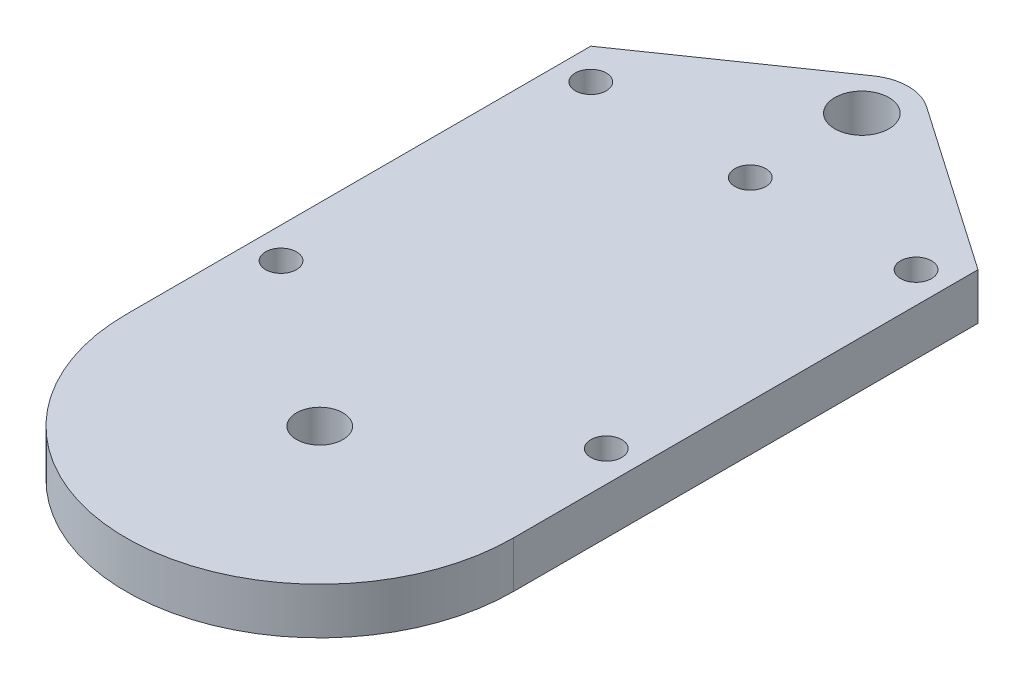
ISO-10303-21;
HEADER;
FILE_DESCRIPTION(('STEP AP214'),'2;1');
FILE_NAME('part.step','',(''),(''),'','','');
FILE_SCHEMA(('AUTOMOTIVE_DESIGN { 1 0 10303 214 1 1 1 1 }'));
ENDSEC;
DATA;
#1=APPLICATION_CONTEXT('core data for automotive mechanical design processes');
#2=APPLICATION_PROTOCOL_DEFINITION('international standard','automotive_design',2000,#1);
#3=PRODUCT_CONTEXT('',#1,'mechanical');
#4=PRODUCT('Part','Part','',(#3));
#5=PRODUCT_RELATED_PRODUCT_CATEGORY('part','',(#4));
#6=PRODUCT_DEFINITION_FORMATION('','',#4);
#7=PRODUCT_DEFINITION_CONTEXT('part definition',#1,'design');
#8=PRODUCT_DEFINITION('design','',#6,#7);
#9=PRODUCT_DEFINITION_SHAPE('','',#8);
#10=(LENGTH_UNIT() NAMED_UNIT(*) SI_UNIT(.MILLI.,.METRE.));
#11=(NAMED_UNIT(*) PLANE_ANGLE_UNIT() SI_UNIT($,.RADIAN.));
#12=(NAMED_UNIT(*) SI_UNIT($,.STERADIAN.) SOLID_ANGLE_UNIT());
#13=UNCERTAINTY_MEASURE_WITH_UNIT(LENGTH_MEASURE(1.E-05),#10,'distance_accuracy_value','');
#14=(GEOMETRIC_REPRESENTATION_CONTEXT(3) GLOBAL_UNCERTAINTY_ASSIGNED_CONTEXT((#13)) GLOBAL_UNIT_ASSIGNED_CONTEXT((#10,
#11,#12)) REPRESENTATION_CONTEXT('',''));
#15=CARTESIAN_POINT('',(0.,0.,0.));
#16=DIRECTION('',(0.,0.,1.));
#17=DIRECTION('',(1.,0.,0.));
#18=AXIS2_PLACEMENT_3D('',#15,#16,#17);
#19=CARTESIAN_POINT('',(0.,3.,15.));
#20=DIRECTION('',(0.,-1.,0.));
#21=DIRECTION('',(0.,0.,-1.));
#22=AXIS2_PLACEMENT_3D('',#19,#20,#21);
#23=CYLINDRICAL_SURFACE('',#22,12.5);
#24=CARTESIAN_POINT('',(0.,0.,15.));
#25=DIRECTION('',(0.,1.,0.));
#26=DIRECTION('',(0.,0.,1.));
#27=AXIS2_PLACEMENT_3D('',#24,#25,#26);
#28=CIRCLE('',#27,12.5);
#29=CARTESIAN_POINT('',(-12.5,0.,15.));
#30=VERTEX_POINT('',#29);
#31=CARTESIAN_POINT('',(12.5,0.,15.));
#32=VERTEX_POINT('',#31);
#33=EDGE_CURVE('E106',#30,#32,#28,.T.);
#34=ORIENTED_EDGE('',*,*,#33,.T.);
#35=DIRECTION('',(0.,-1.,0.));
#36=VECTOR('',#35,1.);
#37=CARTESIAN_POINT('',(12.5,3.,15.));
#38=LINE('',#37,#36);
#39=CARTESIAN_POINT('',(12.5,3.,15.));
#40=VERTEX_POINT('',#39);
#41=EDGE_CURVE('E104',#40,#32,#38,.T.);
#42=ORIENTED_EDGE('',*,*,#41,.F.);
#43=CARTESIAN_POINT('',(0.,3.,15.));
#44=DIRECTION('',(0.,1.,0.));
#45=DIRECTION('',(0.,0.,1.));
#46=AXIS2_PLACEMENT_3D('',#43,#44,#45);
#47=CIRCLE('',#46,12.5);
#48=CARTESIAN_POINT('',(-12.5,3.,15.));
#49=VERTEX_POINT('',#48);
#50=EDGE_CURVE('E90',#49,#40,#47,.T.);
#51=ORIENTED_EDGE('',*,*,#50,.F.);
#52=DIRECTION('',(0.,-1.,0.));
#53=VECTOR('',#52,1.);
#54=CARTESIAN_POINT('',(-12.5,3.,15.));
#55=LINE('',#54,#53);
#56=EDGE_CURVE('E142',#49,#30,#55,.T.);
#57=ORIENTED_EDGE('',*,*,#56,.T.);
#58=EDGE_LOOP('',(#34,#42,#51,#57));
#59=FACE_BOUND('',#58,.T.);
#60=ADVANCED_FACE('F37',(#59),#23,.T.);
#61=CARTESIAN_POINT('',(12.5,3.,0.));
#62=DIRECTION('',(1.,0.,0.));
#63=DIRECTION('',(0.,0.,-1.));
#64=AXIS2_PLACEMENT_3D('',#61,#62,#63);
#65=PLANE('',#64);
#66=DIRECTION('',(0.,0.,1.));
#67=VECTOR('',#66,1.);
#68=CARTESIAN_POINT('',(12.5,0.,0.));
#69=LINE('',#68,#67);
#70=CARTESIAN_POINT('',(12.5,0.,-15.));
#71=VERTEX_POINT('',#70);
#72=EDGE_CURVE('E144',#71,#32,#69,.T.);
#73=ORIENTED_EDGE('',*,*,#72,.F.);
#74=DIRECTION('',(0.,-1.,0.));
#75=VECTOR('',#74,1.);
#76=CARTESIAN_POINT('',(12.5,3.,-15.));
#77=LINE('',#76,#75);
#78=CARTESIAN_POINT('',(12.5,3.,-15.));
#79=VERTEX_POINT('',#78);
#80=EDGE_CURVE('E111',#79,#71,#77,.T.);
#81=ORIENTED_EDGE('',*,*,#80,.F.);
#82=DIRECTION('',(0.,0.,1.));
#83=VECTOR('',#82,1.);
#84=CARTESIAN_POINT('',(12.5,3.,0.));
#85=LINE('',#84,#83);
#86=EDGE_CURVE('E95',#79,#40,#85,.T.);
#87=ORIENTED_EDGE('',*,*,#86,.T.);
#88=ORIENTED_EDGE('',*,*,#41,.T.);
#89=EDGE_LOOP('',(#73,#81,#87,#88));
#90=FACE_BOUND('',#89,.T.);
#91=ADVANCED_FACE('F113',(#90),#65,.T.);
#92=CARTESIAN_POINT('',(11.0646118522805,3.,-15.9930567354681));
#93=DIRECTION('',(-0.568949096507771,0.,0.822372741269427));
#94=DIRECTION('',(0.822372741269427,0.,0.568949096507771));
#95=AXIS2_PLACEMENT_3D('',#92,#93,#94);
#96=PLANE('',#95);
#97=DIRECTION('',(-0.822372741269427,0.,-0.568949096507771));
#98=VECTOR('',#97,1.);
#99=CARTESIAN_POINT('',(11.0646118522805,0.,-15.9930567354681));
#100=LINE('',#99,#98);
#101=CARTESIAN_POINT('',(1.70684728952331,0.,-22.4671182238083));
#102=VERTEX_POINT('',#101);
#103=EDGE_CURVE('E146',#71,#102,#100,.T.);
#104=ORIENTED_EDGE('',*,*,#103,.T.);
#105=DIRECTION('',(0.,-1.,0.));
#106=VECTOR('',#105,1.);
#107=CARTESIAN_POINT('',(1.70684728952331,3.,-22.4671182238083));
#108=LINE('',#107,#106);
#109=CARTESIAN_POINT('',(1.70684728952331,3.,-22.4671182238083));
#110=VERTEX_POINT('',#109);
#111=EDGE_CURVE('E45',#102,#110,#108,.F.);
#112=ORIENTED_EDGE('',*,*,#111,.T.);
#113=DIRECTION('',(-0.822372741269427,0.,-0.568949096507771));
#114=VECTOR('',#113,1.);
#115=CARTESIAN_POINT('',(11.0646118522805,3.,-15.9930567354681));
#116=LINE('',#115,#114);
#117=EDGE_CURVE('E114',#79,#110,#116,.T.);
#118=ORIENTED_EDGE('',*,*,#117,.F.);
#119=ORIENTED_EDGE('',*,*,#80,.T.);
#120=EDGE_LOOP('',(#104,#112,#118,#119));
#121=FACE_BOUND('',#120,.T.);
#122=ADVANCED_FACE('F209',(#121),#96,.F.);
#123=CARTESIAN_POINT('',(-11.0646118522805,3.,-15.9930567354681));
#124=DIRECTION('',(0.568949096507771,0.,0.822372741269427));
#125=DIRECTION('',(0.822372741269427,0.,-0.568949096507771));
#126=AXIS2_PLACEMENT_3D('',#123,#124,#125);
#127=PLANE('',#126);
#128=DIRECTION('',(-0.822372741269427,0.,0.568949096507771));
#129=VECTOR('',#128,1.);
#130=CARTESIAN_POINT('',(-11.0646118522805,3.,-15.9930567354681));
#131=LINE('',#130,#129);
#132=CARTESIAN_POINT('',(-1.70684728952331,3.,-22.4671182238083));
#133=VERTEX_POINT('',#132);
#134=CARTESIAN_POINT('',(-12.5,3.,-15.));
#135=VERTEX_POINT('',#134);
#136=EDGE_CURVE('E116',#133,#135,#131,.T.);
#137=ORIENTED_EDGE('',*,*,#136,.F.);
#138=DIRECTION('',(0.,-1.,0.));
#139=VECTOR('',#138,1.);
#140=CARTESIAN_POINT('',(-1.70684728952331,3.,-22.4671182238083));
#141=LINE('',#140,#139);
#142=CARTESIAN_POINT('',(-1.70684728952331,0.,-22.4671182238083));
#143=VERTEX_POINT('',#142);
#144=EDGE_CURVE('E110',#133,#143,#141,.T.);
#145=ORIENTED_EDGE('',*,*,#144,.T.);
#146=DIRECTION('',(-0.822372741269427,0.,0.568949096507771));
#147=VECTOR('',#146,1.);
#148=CARTESIAN_POINT('',(-11.0646118522805,0.,-15.9930567354681));
#149=LINE('',#148,#147);
#150=CARTESIAN_POINT('',(-12.5,0.,-15.));
#151=VERTEX_POINT('',#150);
#152=EDGE_CURVE('E148',#143,#151,#149,.T.);
#153=ORIENTED_EDGE('',*,*,#152,.T.);
#154=DIRECTION('',(0.,-1.,0.));
#155=VECTOR('',#154,1.);
#156=CARTESIAN_POINT('',(-12.5,3.,-15.));
#157=LINE('',#156,#155);
#158=EDGE_CURVE('E173',#135,#151,#157,.T.);
#159=ORIENTED_EDGE('',*,*,#158,.F.);
#160=EDGE_LOOP('',(#137,#145,#153,#159));
#161=FACE_BOUND('',#160,.T.);
#162=ADVANCED_FACE('F182',(#161),#127,.F.);
#163=CARTESIAN_POINT('',(10.5000000000002,3.,7.));
#164=DIRECTION('',(0.,-1.,0.));
#165=DIRECTION('',(0.,0.,-1.));
#166=AXIS2_PLACEMENT_3D('',#163,#164,#165);
#167=CYLINDRICAL_SURFACE('',#166,1.);
#168=CARTESIAN_POINT('',(10.5000000000002,3.,7.));
#169=DIRECTION('',(0.,1.,0.));
#170=DIRECTION('',(0.,0.,1.));
#171=AXIS2_PLACEMENT_3D('',#168,#169,#170);
#172=CIRCLE('',#171,1.);
#173=CARTESIAN_POINT('',(10.5000000000002,3.,8.));
#174=VERTEX_POINT('',#173);
#175=EDGE_CURVE('E136',#174,#174,#172,.F.);
#176=ORIENTED_EDGE('',*,*,#175,.F.);
#177=EDGE_LOOP('',(#176));
#178=FACE_BOUND('',#177,.T.);
#179=CARTESIAN_POINT('',(10.5000000000002,0.,7.));
#180=DIRECTION('',(0.,1.,0.));
#181=DIRECTION('',(0.,0.,1.));
#182=AXIS2_PLACEMENT_3D('',#179,#180,#181);
#183=CIRCLE('',#182,1.);
#184=CARTESIAN_POINT('',(10.5000000000002,0.,8.));
#185=VERTEX_POINT('',#184);
#186=EDGE_CURVE('E167',#185,#185,#183,.F.);
#187=ORIENTED_EDGE('',*,*,#186,.T.);
#188=EDGE_LOOP('',(#187));
#189=FACE_BOUND('',#188,.T.);
#190=ADVANCED_FACE('F214',(#178,#189),#167,.F.);
#191=CARTESIAN_POINT('',(-10.4999999999998,3.,7.));
#192=DIRECTION('',(0.,-1.,0.));
#193=DIRECTION('',(0.,0.,-1.));
#194=AXIS2_PLACEMENT_3D('',#191,#192,#193);
#195=CYLINDRICAL_SURFACE('',#194,1.);
#196=CARTESIAN_POINT('',(-10.4999999999998,3.,7.));
#197=DIRECTION('',(0.,1.,0.));
#198=DIRECTION('',(0.,0.,1.));
#199=AXIS2_PLACEMENT_3D('',#196,#197,#198);
#200=CIRCLE('',#199,1.);
#201=CARTESIAN_POINT('',(-10.4999999999998,3.,8.));
#202=VERTEX_POINT('',#201);
#203=EDGE_CURVE('E133',#202,#202,#200,.T.);
#204=ORIENTED_EDGE('',*,*,#203,.T.);
#205=EDGE_LOOP('',(#204));
#206=FACE_BOUND('',#205,.T.);
#207=CARTESIAN_POINT('',(-10.4999999999998,0.,7.));
#208=DIRECTION('',(0.,1.,0.));
#209=DIRECTION('',(0.,0.,1.));
#210=AXIS2_PLACEMENT_3D('',#207,#208,#209);
#211=CIRCLE('',#210,1.);
#212=CARTESIAN_POINT('',(-10.4999999999998,0.,8.));
#213=VERTEX_POINT('',#212);
#214=EDGE_CURVE('E164',#213,#213,#211,.T.);
#215=ORIENTED_EDGE('',*,*,#214,.F.);
#216=EDGE_LOOP('',(#215));
#217=FACE_BOUND('',#216,.T.);
#218=ADVANCED_FACE('F218',(#206,#217),#195,.F.);
#219=CARTESIAN_POINT('',(0.,3.,15.));
#220=DIRECTION('',(0.,-1.,0.));
#221=DIRECTION('',(0.,0.,-1.));
#222=AXIS2_PLACEMENT_3D('',#219,#220,#221);
#223=CYLINDRICAL_SURFACE('',#222,1.5);
#224=CARTESIAN_POINT('',(0.,3.,15.));
#225=DIRECTION('',(0.,1.,0.));
#226=DIRECTION('',(0.,0.,1.));
#227=AXIS2_PLACEMENT_3D('',#224,#225,#226);
#228=CIRCLE('',#227,1.5);
#229=CARTESIAN_POINT('',(0.,3.,16.5));
#230=VERTEX_POINT('',#229);
#231=EDGE_CURVE('E130',#230,#230,#228,.T.);
#232=ORIENTED_EDGE('',*,*,#231,.T.);
#233=EDGE_LOOP('',(#232));
#234=FACE_BOUND('',#233,.T.);
#235=CARTESIAN_POINT('',(0.,0.,15.));
#236=DIRECTION('',(0.,1.,0.));
#237=DIRECTION('',(0.,0.,1.));
#238=AXIS2_PLACEMENT_3D('',#235,#236,#237);
#239=CIRCLE('',#238,1.5);
#240=CARTESIAN_POINT('',(0.,0.,16.5));
#241=VERTEX_POINT('',#240);
#242=EDGE_CURVE('E161',#241,#241,#239,.T.);
#243=ORIENTED_EDGE('',*,*,#242,.F.);
#244=EDGE_LOOP('',(#243));
#245=FACE_BOUND('',#244,.T.);
#246=ADVANCED_FACE('F224',(#234,#245),#223,.F.);
#247=CARTESIAN_POINT('',(-10.5,3.,-13.));
#248=DIRECTION('',(0.,-1.,0.));
#249=DIRECTION('',(0.,0.,-1.));
#250=AXIS2_PLACEMENT_3D('',#247,#248,#249);
#251=CYLINDRICAL_SURFACE('',#250,1.);
#252=CARTESIAN_POINT('',(-10.5,3.,-13.));
#253=DIRECTION('',(0.,1.,0.));
#254=DIRECTION('',(0.,0.,1.));
#255=AXIS2_PLACEMENT_3D('',#252,#253,#254);
#256=CIRCLE('',#255,1.);
#257=CARTESIAN_POINT('',(-10.5,3.,-12.));
#258=VERTEX_POINT('',#257);
#259=EDGE_CURVE('E127',#258,#258,#256,.T.);
#260=ORIENTED_EDGE('',*,*,#259,.T.);
#261=EDGE_LOOP('',(#260));
#262=FACE_BOUND('',#261,.T.);
#263=CARTESIAN_POINT('',(-10.5,0.,-13.));
#264=DIRECTION('',(0.,1.,0.));
#265=DIRECTION('',(0.,0.,1.));
#266=AXIS2_PLACEMENT_3D('',#263,#264,#265);
#267=CIRCLE('',#266,1.);
#268=CARTESIAN_POINT('',(-10.5,0.,-12.));
#269=VERTEX_POINT('',#268);
#270=EDGE_CURVE('E158',#269,#269,#267,.T.);
#271=ORIENTED_EDGE('',*,*,#270,.F.);
#272=EDGE_LOOP('',(#271));
#273=FACE_BOUND('',#272,.T.);
#274=ADVANCED_FACE('F233',(#262,#273),#251,.F.);
#275=CARTESIAN_POINT('',(10.5,3.,-13.));
#276=DIRECTION('',(0.,-1.,0.));
#277=DIRECTION('',(0.,0.,-1.));
#278=AXIS2_PLACEMENT_3D('',#275,#276,#277);
#279=CYLINDRICAL_SURFACE('',#278,1.);
#280=CARTESIAN_POINT('',(10.5,3.,-13.));
#281=DIRECTION('',(0.,1.,0.));
#282=DIRECTION('',(0.,0.,1.));
#283=AXIS2_PLACEMENT_3D('',#280,#281,#282);
#284=CIRCLE('',#283,1.);
#285=CARTESIAN_POINT('',(10.5,3.,-12.));
#286=VERTEX_POINT('',#285);
#287=EDGE_CURVE('E124',#286,#286,#284,.F.);
#288=ORIENTED_EDGE('',*,*,#287,.F.);
#289=EDGE_LOOP('',(#288));
#290=FACE_BOUND('',#289,.T.);
#291=CARTESIAN_POINT('',(10.5,0.,-13.));
#292=DIRECTION('',(0.,1.,0.));
#293=DIRECTION('',(0.,0.,1.));
#294=AXIS2_PLACEMENT_3D('',#291,#292,#293);
#295=CIRCLE('',#294,1.);
#296=CARTESIAN_POINT('',(10.5,0.,-12.));
#297=VERTEX_POINT('',#296);
#298=EDGE_CURVE('E155',#297,#297,#295,.F.);
#299=ORIENTED_EDGE('',*,*,#298,.T.);
#300=EDGE_LOOP('',(#299));
#301=FACE_BOUND('',#300,.T.);
#302=ADVANCED_FACE('F201',(#290,#301),#279,.F.);
#303=CARTESIAN_POINT('',(0.,3.,-12.8));
#304=DIRECTION('',(0.,-1.,0.));
#305=DIRECTION('',(0.,0.,-1.));
#306=AXIS2_PLACEMENT_3D('',#303,#304,#305);
#307=CYLINDRICAL_SURFACE('',#306,1.);
#308=CARTESIAN_POINT('',(0.,3.,-12.8));
#309=DIRECTION('',(0.,1.,0.));
#310=DIRECTION('',(0.,0.,1.));
#311=AXIS2_PLACEMENT_3D('',#308,#309,#310);
#312=CIRCLE('',#311,1.);
#313=CARTESIAN_POINT('',(0.,3.,-11.8));
#314=VERTEX_POINT('',#313);
#315=EDGE_CURVE('E121',#314,#314,#312,.T.);
#316=ORIENTED_EDGE('',*,*,#315,.T.);
#317=EDGE_LOOP('',(#316));
#318=FACE_BOUND('',#317,.T.);
#319=CARTESIAN_POINT('',(0.,0.,-12.8));
#320=DIRECTION('',(0.,1.,0.));
#321=DIRECTION('',(0.,0.,1.));
#322=AXIS2_PLACEMENT_3D('',#319,#320,#321);
#323=CIRCLE('',#322,1.);
#324=CARTESIAN_POINT('',(0.,0.,-11.8));
#325=VERTEX_POINT('',#324);
#326=EDGE_CURVE('E152',#325,#325,#323,.T.);
#327=ORIENTED_EDGE('',*,*,#326,.F.);
#328=EDGE_LOOP('',(#327));
#329=FACE_BOUND('',#328,.T.);
#330=ADVANCED_FACE('F193',(#318,#329),#307,.F.);
#331=CARTESIAN_POINT('',(-12.5,3.,0.));
#332=DIRECTION('',(1.,0.,0.));
#333=DIRECTION('',(0.,0.,-1.));
#334=AXIS2_PLACEMENT_3D('',#331,#332,#333);
#335=PLANE('',#334);
#336=DIRECTION('',(0.,0.,1.));
#337=VECTOR('',#336,1.);
#338=CARTESIAN_POINT('',(-12.5,0.,0.));
#339=LINE('',#338,#337);
#340=EDGE_CURVE('E150',#151,#30,#339,.T.);
#341=ORIENTED_EDGE('',*,*,#340,.T.);
#342=ORIENTED_EDGE('',*,*,#56,.F.);
#343=DIRECTION('',(0.,0.,1.));
#344=VECTOR('',#343,1.);
#345=CARTESIAN_POINT('',(-12.5,3.,0.));
#346=LINE('',#345,#344);
#347=EDGE_CURVE('E97',#135,#49,#346,.T.);
#348=ORIENTED_EDGE('',*,*,#347,.F.);
#349=ORIENTED_EDGE('',*,*,#158,.T.);
#350=EDGE_LOOP('',(#341,#342,#348,#349));
#351=FACE_BOUND('',#350,.T.);
#352=ADVANCED_FACE('F190',(#351),#335,.F.);
#353=CARTESIAN_POINT('',(0.,3.,-20.));
#354=DIRECTION('',(0.,-1.,0.));
#355=DIRECTION('',(0.,0.,-1.));
#356=AXIS2_PLACEMENT_3D('',#353,#354,#355);
#357=CYLINDRICAL_SURFACE('',#356,1.75);
#358=CARTESIAN_POINT('',(0.,3.,-20.));
#359=DIRECTION('',(0.,1.,0.));
#360=DIRECTION('',(0.,0.,1.));
#361=AXIS2_PLACEMENT_3D('',#358,#359,#360);
#362=CIRCLE('',#361,1.75);
#363=CARTESIAN_POINT('',(0.,3.,-18.25));
#364=VERTEX_POINT('',#363);
#365=EDGE_CURVE('E139',#364,#364,#362,.T.);
#366=ORIENTED_EDGE('',*,*,#365,.T.);
#367=EDGE_LOOP('',(#366));
#368=FACE_BOUND('',#367,.T.);
#369=CARTESIAN_POINT('',(0.,0.,-20.));
#370=DIRECTION('',(0.,1.,0.));
#371=DIRECTION('',(0.,0.,1.));
#372=AXIS2_PLACEMENT_3D('',#369,#370,#371);
#373=CIRCLE('',#372,1.75);
#374=CARTESIAN_POINT('',(0.,0.,-18.25));
#375=VERTEX_POINT('',#374);
#376=EDGE_CURVE('E101',#375,#375,#373,.T.);
#377=ORIENTED_EDGE('',*,*,#376,.F.);
#378=EDGE_LOOP('',(#377));
#379=FACE_BOUND('',#378,.T.);
#380=ADVANCED_FACE('F192',(#368,#379),#357,.F.);
#381=CARTESIAN_POINT('',(0.,3.,0.));
#382=DIRECTION('',(0.,1.,0.));
#383=DIRECTION('',(0.,0.,1.));
#384=AXIS2_PLACEMENT_3D('',#381,#382,#383);
#385=PLANE('',#384);
#386=ORIENTED_EDGE('',*,*,#117,.T.);
#387=CARTESIAN_POINT('',(0.,3.,-20.));
#388=DIRECTION('',(0.,1.,0.));
#389=DIRECTION('',(0.,0.,1.));
#390=AXIS2_PLACEMENT_3D('',#387,#388,#389);
#391=CIRCLE('',#390,3.);
#392=EDGE_CURVE('E11',#110,#133,#391,.T.);
#393=ORIENTED_EDGE('',*,*,#392,.T.);
#394=ORIENTED_EDGE('',*,*,#136,.T.);
#395=ORIENTED_EDGE('',*,*,#347,.T.);
#396=ORIENTED_EDGE('',*,*,#50,.T.);
#397=ORIENTED_EDGE('',*,*,#86,.F.);
#398=EDGE_LOOP('',(#386,#393,#394,#395,#396,#397));
#399=FACE_BOUND('',#398,.T.);
#400=ORIENTED_EDGE('',*,*,#315,.F.);
#401=EDGE_LOOP('',(#400));
#402=FACE_BOUND('',#401,.T.);
#403=ORIENTED_EDGE('',*,*,#287,.T.);
#404=EDGE_LOOP('',(#403));
#405=FACE_BOUND('',#404,.T.);
#406=ORIENTED_EDGE('',*,*,#259,.F.);
#407=EDGE_LOOP('',(#406));
#408=FACE_BOUND('',#407,.T.);
#409=ORIENTED_EDGE('',*,*,#231,.F.);
#410=EDGE_LOOP('',(#409));
#411=FACE_BOUND('',#410,.T.);
#412=ORIENTED_EDGE('',*,*,#203,.F.);
#413=EDGE_LOOP('',(#412));
#414=FACE_BOUND('',#413,.T.);
#415=ORIENTED_EDGE('',*,*,#175,.T.);
#416=EDGE_LOOP('',(#415));
#417=FACE_BOUND('',#416,.T.);
#418=ORIENTED_EDGE('',*,*,#365,.F.);
#419=EDGE_LOOP('',(#418));
#420=FACE_BOUND('',#419,.T.);
#421=ADVANCED_FACE('F92',(#399,#402,#405,#408,#411,#414,#417,#420),#385,.T.);
#422=CARTESIAN_POINT('',(0.,0.,0.));
#423=DIRECTION('',(0.,1.,0.));
#424=DIRECTION('',(0.,0.,1.));
#425=AXIS2_PLACEMENT_3D('',#422,#423,#424);
#426=PLANE('',#425);
#427=ORIENTED_EDGE('',*,*,#152,.F.);
#428=CARTESIAN_POINT('',(0.,0.,-20.));
#429=DIRECTION('',(0.,1.,0.));
#430=DIRECTION('',(0.,0.,1.));
#431=AXIS2_PLACEMENT_3D('',#428,#429,#430);
#432=CIRCLE('',#431,3.);
#433=EDGE_CURVE('E59',#143,#102,#432,.F.);
#434=ORIENTED_EDGE('',*,*,#433,.T.);
#435=ORIENTED_EDGE('',*,*,#103,.F.);
#436=ORIENTED_EDGE('',*,*,#72,.T.);
#437=ORIENTED_EDGE('',*,*,#33,.F.);
#438=ORIENTED_EDGE('',*,*,#340,.F.);
#439=EDGE_LOOP('',(#427,#434,#435,#436,#437,#438));
#440=FACE_BOUND('',#439,.T.);
#441=ORIENTED_EDGE('',*,*,#326,.T.);
#442=EDGE_LOOP('',(#441));
#443=FACE_BOUND('',#442,.T.);
#444=ORIENTED_EDGE('',*,*,#298,.F.);
#445=EDGE_LOOP('',(#444));
#446=FACE_BOUND('',#445,.T.);
#447=ORIENTED_EDGE('',*,*,#270,.T.);
#448=EDGE_LOOP('',(#447));
#449=FACE_BOUND('',#448,.T.);
#450=ORIENTED_EDGE('',*,*,#242,.T.);
#451=EDGE_LOOP('',(#450));
#452=FACE_BOUND('',#451,.T.);
#453=ORIENTED_EDGE('',*,*,#214,.T.);
#454=EDGE_LOOP('',(#453));
#455=FACE_BOUND('',#454,.T.);
#456=ORIENTED_EDGE('',*,*,#186,.F.);
#457=EDGE_LOOP('',(#456));
#458=FACE_BOUND('',#457,.T.);
#459=ORIENTED_EDGE('',*,*,#376,.T.);
#460=EDGE_LOOP('',(#459));
#461=FACE_BOUND('',#460,.T.);
#462=ADVANCED_FACE('F187',(#440,#443,#446,#449,#452,#455,#458,#461),#426,.F.);
#463=CARTESIAN_POINT('',(0.,3.,-20.));
#464=DIRECTION('',(0.,-1.,0.));
#465=DIRECTION('',(0.,0.,-1.));
#466=AXIS2_PLACEMENT_3D('',#463,#464,#465);
#467=CYLINDRICAL_SURFACE('',#466,3.);
#468=ORIENTED_EDGE('',*,*,#392,.F.);
#469=ORIENTED_EDGE('',*,*,#111,.F.);
#470=ORIENTED_EDGE('',*,*,#433,.F.);
#471=ORIENTED_EDGE('',*,*,#144,.F.);
#472=EDGE_LOOP('',(#468,#469,#470,#471));
#473=FACE_BOUND('',#472,.T.);
#474=ADVANCED_FACE('F39',(#473),#467,.T.);
#475=CLOSED_SHELL('',(#60,#91,#122,#162,#190,#218,#246,#274,#302,#330,#352,#380,#421,#462,#474));
#476=MANIFOLD_SOLID_BREP('B2',#475);
#477=ADVANCED_BREP_SHAPE_REPRESENTATION('',(#18,#476),#14);
#478=SHAPE_DEFINITION_REPRESENTATION(#9,#477);
ENDSEC;
END-ISO-10303-21;
